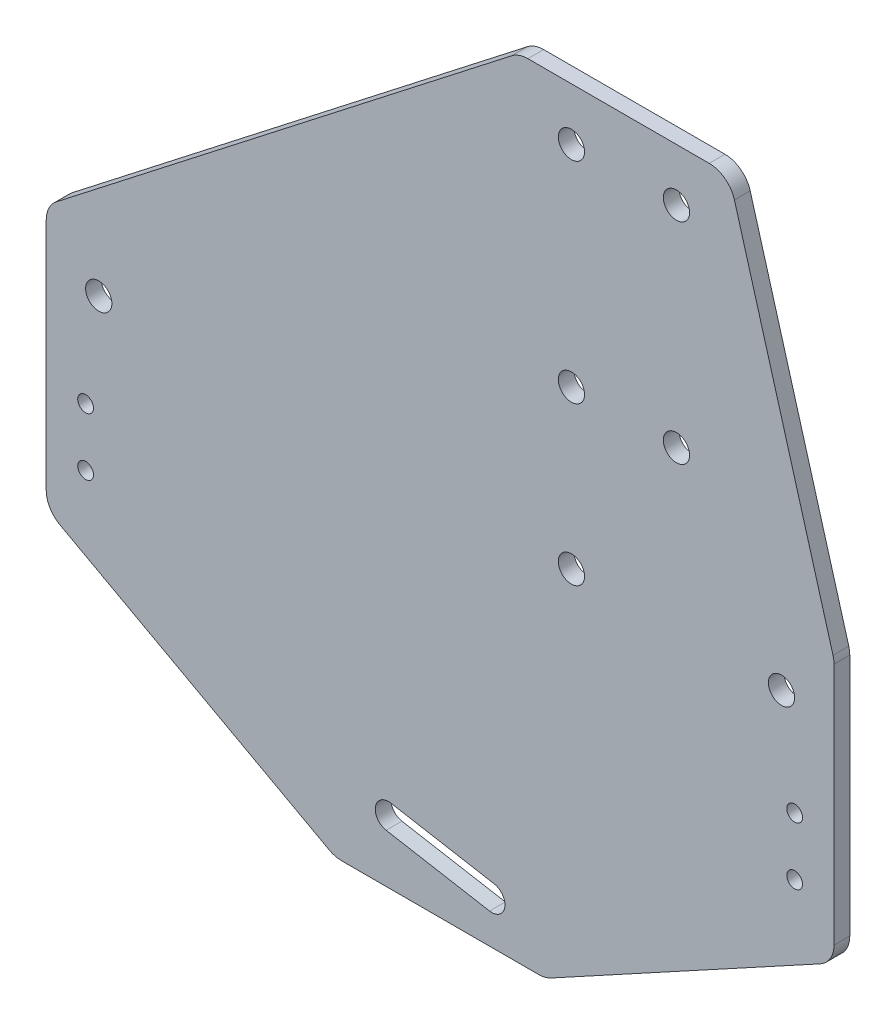
ISO-10303-21;
HEADER;
FILE_DESCRIPTION(('STEP AP214'),'2;1');
FILE_NAME('part.step','',(''),(''),'','','');
FILE_SCHEMA(('AUTOMOTIVE_DESIGN { 1 0 10303 214 1 1 1 1 }'));
ENDSEC;
DATA;
#1=APPLICATION_CONTEXT('core data for automotive mechanical design processes');
#2=APPLICATION_PROTOCOL_DEFINITION('international standard','automotive_design',2000,#1);
#3=PRODUCT_CONTEXT('',#1,'mechanical');
#4=PRODUCT('Part','Part','',(#3));
#5=PRODUCT_RELATED_PRODUCT_CATEGORY('part','',(#4));
#6=PRODUCT_DEFINITION_FORMATION('','',#4);
#7=PRODUCT_DEFINITION_CONTEXT('part definition',#1,'design');
#8=PRODUCT_DEFINITION('design','',#6,#7);
#9=PRODUCT_DEFINITION_SHAPE('','',#8);
#10=(LENGTH_UNIT() NAMED_UNIT(*) SI_UNIT(.MILLI.,.METRE.));
#11=(NAMED_UNIT(*) PLANE_ANGLE_UNIT() SI_UNIT($,.RADIAN.));
#12=(NAMED_UNIT(*) SI_UNIT($,.STERADIAN.) SOLID_ANGLE_UNIT());
#13=UNCERTAINTY_MEASURE_WITH_UNIT(LENGTH_MEASURE(1.E-05),#10,'distance_accuracy_value','');
#14=(GEOMETRIC_REPRESENTATION_CONTEXT(3) GLOBAL_UNCERTAINTY_ASSIGNED_CONTEXT((#13)) GLOBAL_UNIT_ASSIGNED_CONTEXT((#10,
#11,#12)) REPRESENTATION_CONTEXT('',''));
#15=CARTESIAN_POINT('',(0.,0.,0.));
#16=DIRECTION('',(0.,0.,1.));
#17=DIRECTION('',(1.,0.,0.));
#18=AXIS2_PLACEMENT_3D('',#15,#16,#17);
#19=CARTESIAN_POINT('',(15.,150.,3.));
#20=DIRECTION('',(0.,-1.,0.));
#21=DIRECTION('',(0.,0.,-1.));
#22=AXIS2_PLACEMENT_3D('',#19,#20,#21);
#23=PLANE('',#22);
#24=DIRECTION('',(-1.,0.,0.));
#25=VECTOR('',#24,1.);
#26=CARTESIAN_POINT('',(15.,150.,3.));
#27=LINE('',#26,#25);
#28=CARTESIAN_POINT('',(51.2284929362282,150.,3.));
#29=VERTEX_POINT('',#28);
#30=CARTESIAN_POINT('',(16.7155387507081,150.,3.));
#31=VERTEX_POINT('',#30);
#32=EDGE_CURVE('E226',#29,#31,#27,.T.);
#33=ORIENTED_EDGE('',*,*,#32,.F.);
#34=DIRECTION('',(0.,0.,-1.));
#35=VECTOR('',#34,1.);
#36=CARTESIAN_POINT('',(51.2284929362282,150.,3.));
#37=LINE('',#36,#35);
#38=CARTESIAN_POINT('',(51.2284929362282,150.,0.));
#39=VERTEX_POINT('',#38);
#40=EDGE_CURVE('E327',#29,#39,#37,.T.);
#41=ORIENTED_EDGE('',*,*,#40,.T.);
#42=DIRECTION('',(-1.,0.,0.));
#43=VECTOR('',#42,1.);
#44=CARTESIAN_POINT('',(15.,150.,0.));
#45=LINE('',#44,#43);
#46=CARTESIAN_POINT('',(16.7155387507081,150.,0.));
#47=VERTEX_POINT('',#46);
#48=EDGE_CURVE('E223',#39,#47,#45,.T.);
#49=ORIENTED_EDGE('',*,*,#48,.T.);
#50=DIRECTION('',(0.,0.,-1.));
#51=VECTOR('',#50,1.);
#52=CARTESIAN_POINT('',(16.7155387507081,150.,3.));
#53=LINE('',#52,#51);
#54=EDGE_CURVE('E325',#47,#31,#53,.F.);
#55=ORIENTED_EDGE('',*,*,#54,.T.);
#56=EDGE_LOOP('',(#33,#41,#49,#55));
#57=FACE_BOUND('',#56,.T.);
#58=ADVANCED_FACE('F33',(#57),#23,.F.);
#59=CARTESIAN_POINT('',(-75.,80.,3.));
#60=DIRECTION('',(0.61394061351492,-0.789352217376326,0.));
#61=DIRECTION('',(0.789352217376326,0.61394061351492,0.));
#62=AXIS2_PLACEMENT_3D('',#59,#60,#61);
#63=PLANE('',#62);
#64=DIRECTION('',(-0.789352217376326,-0.61394061351492,0.));
#65=VECTOR('',#64,1.);
#66=CARTESIAN_POINT('',(-75.,80.,3.));
#67=LINE('',#66,#65);
#68=CARTESIAN_POINT('',(13.6458356831335,148.946761086882,3.));
#69=VERTEX_POINT('',#68);
#70=CARTESIAN_POINT('',(-73.0697030675746,81.5013420585531,3.));
#71=VERTEX_POINT('',#70);
#72=EDGE_CURVE('E229',#69,#71,#67,.T.);
#73=ORIENTED_EDGE('',*,*,#72,.F.);
#74=DIRECTION('',(0.,0.,-1.));
#75=VECTOR('',#74,1.);
#76=CARTESIAN_POINT('',(13.6458356831335,148.946761086882,3.));
#77=LINE('',#76,#75);
#78=CARTESIAN_POINT('',(13.6458356831335,148.946761086882,0.));
#79=VERTEX_POINT('',#78);
#80=EDGE_CURVE('E332',#69,#79,#77,.T.);
#81=ORIENTED_EDGE('',*,*,#80,.T.);
#82=DIRECTION('',(-0.789352217376326,-0.61394061351492,0.));
#83=VECTOR('',#82,1.);
#84=CARTESIAN_POINT('',(-75.,80.,0.));
#85=LINE('',#84,#83);
#86=CARTESIAN_POINT('',(-73.0697030675746,81.5013420585531,0.));
#87=VERTEX_POINT('',#86);
#88=EDGE_CURVE('E248',#79,#87,#85,.T.);
#89=ORIENTED_EDGE('',*,*,#88,.T.);
#90=DIRECTION('',(0.,0.,-1.));
#91=VECTOR('',#90,1.);
#92=CARTESIAN_POINT('',(-73.0697030675746,81.5013420585531,3.));
#93=LINE('',#92,#91);
#94=EDGE_CURVE('E330',#87,#71,#93,.F.);
#95=ORIENTED_EDGE('',*,*,#94,.T.);
#96=EDGE_LOOP('',(#73,#81,#89,#95));
#97=FACE_BOUND('',#96,.T.);
#98=ADVANCED_FACE('F361',(#97),#63,.F.);
#99=CARTESIAN_POINT('',(-75.,0.,3.));
#100=DIRECTION('',(1.,0.,0.));
#101=DIRECTION('',(0.,0.,-1.));
#102=AXIS2_PLACEMENT_3D('',#99,#100,#101);
#103=PLANE('',#102);
#104=DIRECTION('',(0.,-1.,0.));
#105=VECTOR('',#104,1.);
#106=CARTESIAN_POINT('',(-75.,0.,0.));
#107=LINE('',#106,#105);
#108=CARTESIAN_POINT('',(-75.,77.5545809716715,0.));
#109=VERTEX_POINT('',#108);
#110=CARTESIAN_POINT('',(-75.,32.9681654937008,0.));
#111=VERTEX_POINT('',#110);
#112=EDGE_CURVE('E251',#109,#111,#107,.T.);
#113=ORIENTED_EDGE('',*,*,#112,.T.);
#114=DIRECTION('',(0.,0.,1.));
#115=VECTOR('',#114,1.);
#116=CARTESIAN_POINT('',(-75.,32.9681654937008,3.));
#117=LINE('',#116,#115);
#118=CARTESIAN_POINT('',(-75.,32.9681654937008,3.));
#119=VERTEX_POINT('',#118);
#120=EDGE_CURVE('E11',#111,#119,#117,.T.);
#121=ORIENTED_EDGE('',*,*,#120,.T.);
#122=DIRECTION('',(0.,-1.,0.));
#123=VECTOR('',#122,1.);
#124=CARTESIAN_POINT('',(-75.,0.,3.));
#125=LINE('',#124,#123);
#126=CARTESIAN_POINT('',(-75.,77.5545809716715,3.));
#127=VERTEX_POINT('',#126);
#128=EDGE_CURVE('E233',#127,#119,#125,.T.);
#129=ORIENTED_EDGE('',*,*,#128,.F.);
#130=DIRECTION('',(0.,0.,-1.));
#131=VECTOR('',#130,1.);
#132=CARTESIAN_POINT('',(-75.,77.5545809716715,3.));
#133=LINE('',#132,#131);
#134=EDGE_CURVE('E41',#127,#109,#133,.T.);
#135=ORIENTED_EDGE('',*,*,#134,.T.);
#136=EDGE_LOOP('',(#113,#121,#129,#135));
#137=FACE_BOUND('',#136,.T.);
#138=ADVANCED_FACE('F339',(#137),#103,.F.);
#139=CARTESIAN_POINT('',(-75.,0.,3.));
#140=DIRECTION('',(0.,1.,0.));
#141=DIRECTION('',(-1.,0.,0.));
#142=AXIS2_PLACEMENT_3D('',#139,#140,#141);
#143=PLANE('',#142);
#144=DIRECTION('',(1.,0.,0.));
#145=VECTOR('',#144,1.);
#146=CARTESIAN_POINT('',(-75.,0.,3.));
#147=LINE('',#146,#145);
#148=CARTESIAN_POINT('',(-18.7250299282153,0.,3.));
#149=VERTEX_POINT('',#148);
#150=CARTESIAN_POINT('',(18.7250299282153,0.,3.));
#151=VERTEX_POINT('',#150);
#152=EDGE_CURVE('E236',#149,#151,#147,.T.);
#153=ORIENTED_EDGE('',*,*,#152,.F.);
#154=DIRECTION('',(0.,0.,1.));
#155=VECTOR('',#154,1.);
#156=CARTESIAN_POINT('',(-18.7250299282153,0.,3.));
#157=LINE('',#156,#155);
#158=CARTESIAN_POINT('',(-18.7250299282153,0.,0.));
#159=VERTEX_POINT('',#158);
#160=EDGE_CURVE('E296',#149,#159,#157,.F.);
#161=ORIENTED_EDGE('',*,*,#160,.T.);
#162=DIRECTION('',(1.,0.,0.));
#163=VECTOR('',#162,1.);
#164=CARTESIAN_POINT('',(-75.,0.,0.));
#165=LINE('',#164,#163);
#166=CARTESIAN_POINT('',(18.7250299282153,0.,0.));
#167=VERTEX_POINT('',#166);
#168=EDGE_CURVE('E254',#159,#167,#165,.T.);
#169=ORIENTED_EDGE('',*,*,#168,.T.);
#170=DIRECTION('',(0.,0.,1.));
#171=VECTOR('',#170,1.);
#172=CARTESIAN_POINT('',(18.7250299282153,0.,3.));
#173=LINE('',#172,#171);
#174=EDGE_CURVE('E293',#167,#151,#173,.T.);
#175=ORIENTED_EDGE('',*,*,#174,.T.);
#176=EDGE_LOOP('',(#153,#161,#169,#175));
#177=FACE_BOUND('',#176,.T.);
#178=ADVANCED_FACE('F490',(#177),#143,.F.);
#179=CARTESIAN_POINT('',(75.,0.,3.));
#180=DIRECTION('',(-1.,0.,0.));
#181=DIRECTION('',(0.,-1.,0.));
#182=AXIS2_PLACEMENT_3D('',#179,#180,#181);
#183=PLANE('',#182);
#184=DIRECTION('',(0.,1.,0.));
#185=VECTOR('',#184,1.);
#186=CARTESIAN_POINT('',(75.,0.,3.));
#187=LINE('',#186,#185);
#188=CARTESIAN_POINT('',(75.,32.9681654937008,3.));
#189=VERTEX_POINT('',#188);
#190=CARTESIAN_POINT('',(75.,79.2997252767988,3.));
#191=VERTEX_POINT('',#190);
#192=EDGE_CURVE('E239',#189,#191,#187,.T.);
#193=ORIENTED_EDGE('',*,*,#192,.F.);
#194=DIRECTION('',(0.,0.,1.));
#195=VECTOR('',#194,1.);
#196=CARTESIAN_POINT('',(75.,32.9681654937008,3.));
#197=LINE('',#196,#195);
#198=CARTESIAN_POINT('',(75.,32.9681654937008,0.));
#199=VERTEX_POINT('',#198);
#200=EDGE_CURVE('E319',#189,#199,#197,.F.);
#201=ORIENTED_EDGE('',*,*,#200,.T.);
#202=DIRECTION('',(0.,1.,0.));
#203=VECTOR('',#202,1.);
#204=CARTESIAN_POINT('',(75.,0.,0.));
#205=LINE('',#204,#203);
#206=CARTESIAN_POINT('',(75.,79.2997252767988,0.));
#207=VERTEX_POINT('',#206);
#208=EDGE_CURVE('E257',#199,#207,#205,.T.);
#209=ORIENTED_EDGE('',*,*,#208,.T.);
#210=DIRECTION('',(0.,0.,-1.));
#211=VECTOR('',#210,1.);
#212=CARTESIAN_POINT('',(75.,79.2997252767988,3.));
#213=LINE('',#212,#211);
#214=EDGE_CURVE('E317',#207,#191,#213,.F.);
#215=ORIENTED_EDGE('',*,*,#214,.T.);
#216=EDGE_LOOP('',(#193,#201,#209,#215));
#217=FACE_BOUND('',#216,.T.);
#218=ADVANCED_FACE('F383',(#217),#183,.F.);
#219=CARTESIAN_POINT('',(75.,80.,3.));
#220=DIRECTION('',(-0.961523947640823,-0.274721127897378,0.));
#221=DIRECTION('',(0.274721127897378,-0.961523947640823,0.));
#222=AXIS2_PLACEMENT_3D('',#219,#220,#221);
#223=PLANE('',#222);
#224=DIRECTION('',(-0.274721127897378,0.961523947640823,0.));
#225=VECTOR('',#224,1.);
#226=CARTESIAN_POINT('',(75.,80.,3.));
#227=LINE('',#226,#225);
#228=CARTESIAN_POINT('',(74.8076197382041,80.6733309162857,3.));
#229=VERTEX_POINT('',#228);
#230=CARTESIAN_POINT('',(56.0361126744323,146.373605639487,3.));
#231=VERTEX_POINT('',#230);
#232=EDGE_CURVE('E242',#229,#231,#227,.T.);
#233=ORIENTED_EDGE('',*,*,#232,.F.);
#234=DIRECTION('',(0.,0.,-1.));
#235=VECTOR('',#234,1.);
#236=CARTESIAN_POINT('',(74.8076197382041,80.6733309162857,3.));
#237=LINE('',#236,#235);
#238=CARTESIAN_POINT('',(74.8076197382041,80.6733309162857,0.));
#239=VERTEX_POINT('',#238);
#240=EDGE_CURVE('E323',#229,#239,#237,.T.);
#241=ORIENTED_EDGE('',*,*,#240,.T.);
#242=DIRECTION('',(-0.274721127897378,0.961523947640823,0.));
#243=VECTOR('',#242,1.);
#244=CARTESIAN_POINT('',(75.,80.,0.));
#245=LINE('',#244,#243);
#246=CARTESIAN_POINT('',(56.0361126744323,146.373605639487,0.));
#247=VERTEX_POINT('',#246);
#248=EDGE_CURVE('E230',#239,#247,#245,.T.);
#249=ORIENTED_EDGE('',*,*,#248,.T.);
#250=DIRECTION('',(0.,0.,-1.));
#251=VECTOR('',#250,1.);
#252=CARTESIAN_POINT('',(56.0361126744323,146.373605639487,3.));
#253=LINE('',#252,#251);
#254=EDGE_CURVE('E321',#247,#231,#253,.F.);
#255=ORIENTED_EDGE('',*,*,#254,.T.);
#256=EDGE_LOOP('',(#233,#241,#249,#255));
#257=FACE_BOUND('',#256,.T.);
#258=ADVANCED_FACE('F376',(#257),#223,.F.);
#259=CARTESIAN_POINT('',(0.,0.,3.));
#260=DIRECTION('',(0.,0.,1.));
#261=DIRECTION('',(1.,0.,0.));
#262=AXIS2_PLACEMENT_3D('',#259,#260,#261);
#263=PLANE('',#262);
#264=DIRECTION('',(-0.877895572914384,0.478852130680573,0.));
#265=VECTOR('',#264,1.);
#266=CARTESIAN_POINT('',(-75.,30.,3.));
#267=LINE('',#266,#265);
#268=CARTESIAN_POINT('',(-21.1192905816182,0.610522135428098,3.));
#269=VERTEX_POINT('',#268);
#270=CARTESIAN_POINT('',(-72.3942606534029,28.5786876291288,3.));
#271=VERTEX_POINT('',#270);
#272=EDGE_CURVE('E397',#269,#271,#267,.T.);
#273=ORIENTED_EDGE('',*,*,#272,.F.);
#274=CARTESIAN_POINT('',(-18.7250299282153,5.00000000000001,3.));
#275=DIRECTION('',(0.,0.,1.));
#276=DIRECTION('',(1.,0.,0.));
#277=AXIS2_PLACEMENT_3D('',#274,#275,#276);
#278=CIRCLE('',#277,5.);
#279=EDGE_CURVE('E291',#269,#149,#278,.T.);
#280=ORIENTED_EDGE('',*,*,#279,.T.);
#281=ORIENTED_EDGE('',*,*,#152,.T.);
#282=CARTESIAN_POINT('',(18.7250299282153,5.00000000000002,3.));
#283=DIRECTION('',(0.,0.,1.));
#284=DIRECTION('',(1.,0.,0.));
#285=AXIS2_PLACEMENT_3D('',#282,#283,#284);
#286=CIRCLE('',#285,5.);
#287=CARTESIAN_POINT('',(21.1192905816182,0.610522135428098,3.));
#288=VERTEX_POINT('',#287);
#289=EDGE_CURVE('E289',#151,#288,#286,.T.);
#290=ORIENTED_EDGE('',*,*,#289,.T.);
#291=DIRECTION('',(-0.877895572914384,-0.478852130680574,0.));
#292=VECTOR('',#291,1.);
#293=CARTESIAN_POINT('',(20.,0.,3.));
#294=LINE('',#293,#292);
#295=CARTESIAN_POINT('',(72.3942606534029,28.5786876291288,3.));
#296=VERTEX_POINT('',#295);
#297=EDGE_CURVE('E398',#296,#288,#294,.T.);
#298=ORIENTED_EDGE('',*,*,#297,.F.);
#299=CARTESIAN_POINT('',(70.,32.9681654937008,3.));
#300=DIRECTION('',(0.,0.,1.));
#301=DIRECTION('',(1.,0.,0.));
#302=AXIS2_PLACEMENT_3D('',#299,#300,#301);
#303=CIRCLE('',#302,5.);
#304=EDGE_CURVE('E287',#296,#189,#303,.T.);
#305=ORIENTED_EDGE('',*,*,#304,.T.);
#306=ORIENTED_EDGE('',*,*,#192,.T.);
#307=CARTESIAN_POINT('',(70.,79.2997252767988,3.));
#308=DIRECTION('',(0.,0.,1.));
#309=DIRECTION('',(1.,0.,0.));
#310=AXIS2_PLACEMENT_3D('',#307,#308,#309);
#311=CIRCLE('',#310,5.);
#312=EDGE_CURVE('E285',#191,#229,#311,.T.);
#313=ORIENTED_EDGE('',*,*,#312,.T.);
#314=ORIENTED_EDGE('',*,*,#232,.T.);
#315=CARTESIAN_POINT('',(51.2284929362282,145.,3.));
#316=DIRECTION('',(0.,0.,1.));
#317=DIRECTION('',(1.,0.,0.));
#318=AXIS2_PLACEMENT_3D('',#315,#316,#317);
#319=CIRCLE('',#318,5.);
#320=EDGE_CURVE('E283',#231,#29,#319,.T.);
#321=ORIENTED_EDGE('',*,*,#320,.T.);
#322=ORIENTED_EDGE('',*,*,#32,.T.);
#323=CARTESIAN_POINT('',(16.7155387507081,145.,3.));
#324=DIRECTION('',(0.,0.,1.));
#325=DIRECTION('',(1.,0.,0.));
#326=AXIS2_PLACEMENT_3D('',#323,#324,#325);
#327=CIRCLE('',#326,5.);
#328=EDGE_CURVE('E281',#31,#69,#327,.T.);
#329=ORIENTED_EDGE('',*,*,#328,.T.);
#330=ORIENTED_EDGE('',*,*,#72,.T.);
#331=CARTESIAN_POINT('',(-70.,77.5545809716715,3.));
#332=DIRECTION('',(0.,0.,1.));
#333=DIRECTION('',(1.,0.,0.));
#334=AXIS2_PLACEMENT_3D('',#331,#332,#333);
#335=CIRCLE('',#334,5.);
#336=EDGE_CURVE('E277',#71,#127,#335,.T.);
#337=ORIENTED_EDGE('',*,*,#336,.T.);
#338=ORIENTED_EDGE('',*,*,#128,.T.);
#339=CARTESIAN_POINT('',(-70.,32.9681654937008,3.));
#340=DIRECTION('',(0.,0.,1.));
#341=DIRECTION('',(1.,0.,0.));
#342=AXIS2_PLACEMENT_3D('',#339,#340,#341);
#343=CIRCLE('',#342,5.);
#344=EDGE_CURVE('E279',#119,#271,#343,.T.);
#345=ORIENTED_EDGE('',*,*,#344,.T.);
#346=EDGE_LOOP('',(#273,#280,#281,#290,#298,#305,#306,#313,#314,#321,#322,#329,#330,#337,#338,#345));
#347=FACE_BOUND('',#346,.T.);
#348=CARTESIAN_POINT('',(25.,140.,3.));
#349=DIRECTION('',(0.,0.,1.));
#350=DIRECTION('',(1.,0.,0.));
#351=AXIS2_PLACEMENT_3D('',#348,#349,#350);
#352=CIRCLE('',#351,2.5);
#353=CARTESIAN_POINT('',(27.5,140.,3.));
#354=VERTEX_POINT('',#353);
#355=EDGE_CURVE('E407',#354,#354,#352,.T.);
#356=ORIENTED_EDGE('',*,*,#355,.F.);
#357=EDGE_LOOP('',(#356));
#358=FACE_BOUND('',#357,.T.);
#359=CARTESIAN_POINT('',(45.,140.,3.));
#360=DIRECTION('',(0.,0.,1.));
#361=DIRECTION('',(1.,0.,0.));
#362=AXIS2_PLACEMENT_3D('',#359,#360,#361);
#363=CIRCLE('',#362,2.5);
#364=CARTESIAN_POINT('',(47.5,140.,3.));
#365=VERTEX_POINT('',#364);
#366=EDGE_CURVE('E410',#365,#365,#363,.T.);
#367=ORIENTED_EDGE('',*,*,#366,.F.);
#368=EDGE_LOOP('',(#367));
#369=FACE_BOUND('',#368,.T.);
#370=CARTESIAN_POINT('',(-67.5,40.,3.));
#371=DIRECTION('',(0.,0.,1.));
#372=DIRECTION('',(1.,0.,0.));
#373=AXIS2_PLACEMENT_3D('',#370,#371,#372);
#374=CIRCLE('',#373,1.5);
#375=CARTESIAN_POINT('',(-66.,40.,3.));
#376=VERTEX_POINT('',#375);
#377=EDGE_CURVE('E414',#376,#376,#374,.T.);
#378=ORIENTED_EDGE('',*,*,#377,.F.);
#379=EDGE_LOOP('',(#378));
#380=FACE_BOUND('',#379,.T.);
#381=CARTESIAN_POINT('',(-67.5,51.,3.));
#382=DIRECTION('',(0.,0.,1.));
#383=DIRECTION('',(1.,0.,0.));
#384=AXIS2_PLACEMENT_3D('',#381,#382,#383);
#385=CIRCLE('',#384,1.5);
#386=CARTESIAN_POINT('',(-66.,51.,3.));
#387=VERTEX_POINT('',#386);
#388=EDGE_CURVE('E420',#387,#387,#385,.T.);
#389=ORIENTED_EDGE('',*,*,#388,.F.);
#390=EDGE_LOOP('',(#389));
#391=FACE_BOUND('',#390,.T.);
#392=CARTESIAN_POINT('',(67.5,40.,3.));
#393=DIRECTION('',(0.,0.,1.));
#394=DIRECTION('',(1.,0.,0.));
#395=AXIS2_PLACEMENT_3D('',#392,#393,#394);
#396=CIRCLE('',#395,1.5);
#397=CARTESIAN_POINT('',(69.,40.,3.));
#398=VERTEX_POINT('',#397);
#399=EDGE_CURVE('E426',#398,#398,#396,.T.);
#400=ORIENTED_EDGE('',*,*,#399,.F.);
#401=EDGE_LOOP('',(#400));
#402=FACE_BOUND('',#401,.T.);
#403=CARTESIAN_POINT('',(67.5,51.,3.));
#404=DIRECTION('',(0.,0.,1.));
#405=DIRECTION('',(1.,0.,0.));
#406=AXIS2_PLACEMENT_3D('',#403,#404,#405);
#407=CIRCLE('',#406,1.5);
#408=CARTESIAN_POINT('',(69.,51.,3.));
#409=VERTEX_POINT('',#408);
#410=EDGE_CURVE('E432',#409,#409,#407,.T.);
#411=ORIENTED_EDGE('',*,*,#410,.F.);
#412=EDGE_LOOP('',(#411));
#413=FACE_BOUND('',#412,.T.);
#414=CARTESIAN_POINT('',(25.,70.,3.));
#415=DIRECTION('',(0.,0.,1.));
#416=DIRECTION('',(-1.,0.,0.));
#417=AXIS2_PLACEMENT_3D('',#414,#415,#416);
#418=CIRCLE('',#417,2.5);
#419=CARTESIAN_POINT('',(22.5,70.,3.));
#420=VERTEX_POINT('',#419);
#421=EDGE_CURVE('E438',#420,#420,#418,.T.);
#422=ORIENTED_EDGE('',*,*,#421,.F.);
#423=EDGE_LOOP('',(#422));
#424=FACE_BOUND('',#423,.T.);
#425=CARTESIAN_POINT('',(65.,70.,3.));
#426=DIRECTION('',(0.,0.,1.));
#427=DIRECTION('',(-1.,0.,0.));
#428=AXIS2_PLACEMENT_3D('',#425,#426,#427);
#429=CIRCLE('',#428,2.50000000000001);
#430=CARTESIAN_POINT('',(62.5,70.,3.));
#431=VERTEX_POINT('',#430);
#432=EDGE_CURVE('E203',#431,#431,#429,.T.);
#433=ORIENTED_EDGE('',*,*,#432,.F.);
#434=EDGE_LOOP('',(#433));
#435=FACE_BOUND('',#434,.T.);
#436=CARTESIAN_POINT('',(-9.84807753012208,11.7364817766693,3.));
#437=DIRECTION('',(0.,0.,1.));
#438=DIRECTION('',(1.,0.,0.));
#439=AXIS2_PLACEMENT_3D('',#436,#437,#438);
#440=CIRCLE('',#439,2.5);
#441=CARTESIAN_POINT('',(-9.41395708595475,14.1985011591998,3.));
#442=VERTEX_POINT('',#441);
#443=CARTESIAN_POINT('',(-10.2821979742894,9.27446239413879,3.));
#444=VERTEX_POINT('',#443);
#445=EDGE_CURVE('E179',#442,#444,#440,.T.);
#446=ORIENTED_EDGE('',*,*,#445,.F.);
#447=DIRECTION('',(-0.984807753012208,0.173648177666931,0.));
#448=VECTOR('',#447,1.);
#449=CARTESIAN_POINT('',(-9.41395708595475,14.1985011591998,3.));
#450=LINE('',#449,#448);
#451=CARTESIAN_POINT('',(10.2821979742894,10.7255376058612,3.));
#452=VERTEX_POINT('',#451);
#453=EDGE_CURVE('E197',#452,#442,#450,.T.);
#454=ORIENTED_EDGE('',*,*,#453,.F.);
#455=CARTESIAN_POINT('',(9.84807753012208,8.2635182233307,3.));
#456=DIRECTION('',(0.,0.,1.));
#457=DIRECTION('',(1.,0.,0.));
#458=AXIS2_PLACEMENT_3D('',#455,#456,#457);
#459=CIRCLE('',#458,2.5);
#460=CARTESIAN_POINT('',(9.41395708595476,5.80149884080018,3.));
#461=VERTEX_POINT('',#460);
#462=EDGE_CURVE('E200',#461,#452,#459,.T.);
#463=ORIENTED_EDGE('',*,*,#462,.F.);
#464=DIRECTION('',(0.984807753012208,-0.17364817766693,0.));
#465=VECTOR('',#464,1.);
#466=CARTESIAN_POINT('',(-10.2821979742894,9.27446239413879,3.));
#467=LINE('',#466,#465);
#468=EDGE_CURVE('E209',#444,#461,#467,.T.);
#469=ORIENTED_EDGE('',*,*,#468,.F.);
#470=EDGE_LOOP('',(#446,#454,#463,#469));
#471=FACE_BOUND('',#470,.T.);
#472=CARTESIAN_POINT('',(-65.,70.,3.));
#473=DIRECTION('',(0.,0.,1.));
#474=DIRECTION('',(1.,0.,0.));
#475=AXIS2_PLACEMENT_3D('',#472,#473,#474);
#476=CIRCLE('',#475,2.50000000000001);
#477=CARTESIAN_POINT('',(-62.5,70.,3.));
#478=VERTEX_POINT('',#477);
#479=EDGE_CURVE('E216',#478,#478,#476,.T.);
#480=ORIENTED_EDGE('',*,*,#479,.F.);
#481=EDGE_LOOP('',(#480));
#482=FACE_BOUND('',#481,.T.);
#483=CARTESIAN_POINT('',(45.,100.,3.));
#484=DIRECTION('',(0.,0.,1.));
#485=DIRECTION('',(1.,0.,0.));
#486=AXIS2_PLACEMENT_3D('',#483,#484,#485);
#487=CIRCLE('',#486,2.5);
#488=CARTESIAN_POINT('',(47.5,100.,3.));
#489=VERTEX_POINT('',#488);
#490=EDGE_CURVE('E263',#489,#489,#487,.T.);
#491=ORIENTED_EDGE('',*,*,#490,.F.);
#492=EDGE_LOOP('',(#491));
#493=FACE_BOUND('',#492,.T.);
#494=CARTESIAN_POINT('',(25.,100.,3.));
#495=DIRECTION('',(0.,0.,1.));
#496=DIRECTION('',(1.,0.,0.));
#497=AXIS2_PLACEMENT_3D('',#494,#495,#496);
#498=CIRCLE('',#497,2.5);
#499=CARTESIAN_POINT('',(27.5,100.,3.));
#500=VERTEX_POINT('',#499);
#501=EDGE_CURVE('E269',#500,#500,#498,.T.);
#502=ORIENTED_EDGE('',*,*,#501,.F.);
#503=EDGE_LOOP('',(#502));
#504=FACE_BOUND('',#503,.T.);
#505=ADVANCED_FACE('F355',(#347,#358,#369,#380,#391,#402,#413,#424,#435,#471,#482,#493,#504),
#263,.T.);
#506=CARTESIAN_POINT('',(0.,0.,0.));
#507=DIRECTION('',(0.,0.,1.));
#508=DIRECTION('',(1.,0.,0.));
#509=AXIS2_PLACEMENT_3D('',#506,#507,#508);
#510=PLANE('',#509);
#511=CARTESIAN_POINT('',(25.,140.,0.));
#512=DIRECTION('',(0.,0.,1.));
#513=DIRECTION('',(1.,0.,0.));
#514=AXIS2_PLACEMENT_3D('',#511,#512,#513);
#515=CIRCLE('',#514,2.5);
#516=CARTESIAN_POINT('',(27.5,140.,0.));
#517=VERTEX_POINT('',#516);
#518=EDGE_CURVE('E403',#517,#517,#515,.T.);
#519=ORIENTED_EDGE('',*,*,#518,.T.);
#520=EDGE_LOOP('',(#519));
#521=FACE_BOUND('',#520,.T.);
#522=CARTESIAN_POINT('',(45.,140.,0.));
#523=DIRECTION('',(0.,0.,1.));
#524=DIRECTION('',(1.,0.,0.));
#525=AXIS2_PLACEMENT_3D('',#522,#523,#524);
#526=CIRCLE('',#525,2.5);
#527=CARTESIAN_POINT('',(47.5,140.,0.));
#528=VERTEX_POINT('',#527);
#529=EDGE_CURVE('E411',#528,#528,#526,.T.);
#530=ORIENTED_EDGE('',*,*,#529,.T.);
#531=EDGE_LOOP('',(#530));
#532=FACE_BOUND('',#531,.T.);
#533=CARTESIAN_POINT('',(-67.5,40.,0.));
#534=DIRECTION('',(0.,0.,1.));
#535=DIRECTION('',(1.,0.,0.));
#536=AXIS2_PLACEMENT_3D('',#533,#534,#535);
#537=CIRCLE('',#536,1.5);
#538=CARTESIAN_POINT('',(-66.,40.,0.));
#539=VERTEX_POINT('',#538);
#540=EDGE_CURVE('E417',#539,#539,#537,.T.);
#541=ORIENTED_EDGE('',*,*,#540,.T.);
#542=EDGE_LOOP('',(#541));
#543=FACE_BOUND('',#542,.T.);
#544=CARTESIAN_POINT('',(-67.5,51.,0.));
#545=DIRECTION('',(0.,0.,1.));
#546=DIRECTION('',(1.,0.,0.));
#547=AXIS2_PLACEMENT_3D('',#544,#545,#546);
#548=CIRCLE('',#547,1.5);
#549=CARTESIAN_POINT('',(-66.,51.,0.));
#550=VERTEX_POINT('',#549);
#551=EDGE_CURVE('E423',#550,#550,#548,.T.);
#552=ORIENTED_EDGE('',*,*,#551,.T.);
#553=EDGE_LOOP('',(#552));
#554=FACE_BOUND('',#553,.T.);
#555=CARTESIAN_POINT('',(67.5,40.,0.));
#556=DIRECTION('',(0.,0.,1.));
#557=DIRECTION('',(1.,0.,0.));
#558=AXIS2_PLACEMENT_3D('',#555,#556,#557);
#559=CIRCLE('',#558,1.5);
#560=CARTESIAN_POINT('',(69.,40.,0.));
#561=VERTEX_POINT('',#560);
#562=EDGE_CURVE('E429',#561,#561,#559,.T.);
#563=ORIENTED_EDGE('',*,*,#562,.T.);
#564=EDGE_LOOP('',(#563));
#565=FACE_BOUND('',#564,.T.);
#566=CARTESIAN_POINT('',(67.5,51.,0.));
#567=DIRECTION('',(0.,0.,1.));
#568=DIRECTION('',(1.,0.,0.));
#569=AXIS2_PLACEMENT_3D('',#566,#567,#568);
#570=CIRCLE('',#569,1.5);
#571=CARTESIAN_POINT('',(69.,51.,0.));
#572=VERTEX_POINT('',#571);
#573=EDGE_CURVE('E435',#572,#572,#570,.T.);
#574=ORIENTED_EDGE('',*,*,#573,.T.);
#575=EDGE_LOOP('',(#574));
#576=FACE_BOUND('',#575,.T.);
#577=CARTESIAN_POINT('',(25.,70.,0.));
#578=DIRECTION('',(0.,0.,1.));
#579=DIRECTION('',(-1.,0.,0.));
#580=AXIS2_PLACEMENT_3D('',#577,#578,#579);
#581=CIRCLE('',#580,2.5);
#582=CARTESIAN_POINT('',(22.5,70.,0.));
#583=VERTEX_POINT('',#582);
#584=EDGE_CURVE('E441',#583,#583,#581,.T.);
#585=ORIENTED_EDGE('',*,*,#584,.T.);
#586=EDGE_LOOP('',(#585));
#587=FACE_BOUND('',#586,.T.);
#588=CARTESIAN_POINT('',(65.,70.,0.));
#589=DIRECTION('',(0.,0.,1.));
#590=DIRECTION('',(-1.,0.,0.));
#591=AXIS2_PLACEMENT_3D('',#588,#589,#590);
#592=CIRCLE('',#591,2.50000000000001);
#593=CARTESIAN_POINT('',(62.5,70.,0.));
#594=VERTEX_POINT('',#593);
#595=EDGE_CURVE('E210',#594,#594,#592,.T.);
#596=ORIENTED_EDGE('',*,*,#595,.T.);
#597=EDGE_LOOP('',(#596));
#598=FACE_BOUND('',#597,.T.);
#599=DIRECTION('',(-0.984807753012208,0.173648177666931,0.));
#600=VECTOR('',#599,1.);
#601=CARTESIAN_POINT('',(-9.41395708595475,14.1985011591998,0.));
#602=LINE('',#601,#600);
#603=CARTESIAN_POINT('',(10.2821979742894,10.7255376058612,0.));
#604=VERTEX_POINT('',#603);
#605=CARTESIAN_POINT('',(-9.41395708595475,14.1985011591998,0.));
#606=VERTEX_POINT('',#605);
#607=EDGE_CURVE('E184',#604,#606,#602,.T.);
#608=ORIENTED_EDGE('',*,*,#607,.T.);
#609=CARTESIAN_POINT('',(-9.84807753012208,11.7364817766693,0.));
#610=DIRECTION('',(0.,0.,1.));
#611=DIRECTION('',(1.,0.,0.));
#612=AXIS2_PLACEMENT_3D('',#609,#610,#611);
#613=CIRCLE('',#612,2.5);
#614=CARTESIAN_POINT('',(-10.2821979742894,9.27446239413879,0.));
#615=VERTEX_POINT('',#614);
#616=EDGE_CURVE('E176',#606,#615,#613,.T.);
#617=ORIENTED_EDGE('',*,*,#616,.T.);
#618=DIRECTION('',(0.984807753012208,-0.17364817766693,0.));
#619=VECTOR('',#618,1.);
#620=CARTESIAN_POINT('',(-10.2821979742894,9.27446239413879,0.));
#621=LINE('',#620,#619);
#622=CARTESIAN_POINT('',(9.41395708595476,5.80149884080018,0.));
#623=VERTEX_POINT('',#622);
#624=EDGE_CURVE('E188',#615,#623,#621,.T.);
#625=ORIENTED_EDGE('',*,*,#624,.T.);
#626=CARTESIAN_POINT('',(9.84807753012208,8.2635182233307,0.));
#627=DIRECTION('',(0.,0.,1.));
#628=DIRECTION('',(1.,0.,0.));
#629=AXIS2_PLACEMENT_3D('',#626,#627,#628);
#630=CIRCLE('',#629,2.5);
#631=EDGE_CURVE('E192',#623,#604,#630,.T.);
#632=ORIENTED_EDGE('',*,*,#631,.T.);
#633=EDGE_LOOP('',(#608,#617,#625,#632));
#634=FACE_BOUND('',#633,.T.);
#635=CARTESIAN_POINT('',(-65.,70.,0.));
#636=DIRECTION('',(0.,0.,1.));
#637=DIRECTION('',(1.,0.,0.));
#638=AXIS2_PLACEMENT_3D('',#635,#636,#637);
#639=CIRCLE('',#638,2.50000000000001);
#640=CARTESIAN_POINT('',(-62.5,70.,0.));
#641=VERTEX_POINT('',#640);
#642=EDGE_CURVE('E220',#641,#641,#639,.T.);
#643=ORIENTED_EDGE('',*,*,#642,.T.);
#644=EDGE_LOOP('',(#643));
#645=FACE_BOUND('',#644,.T.);
#646=ORIENTED_EDGE('',*,*,#168,.F.);
#647=CARTESIAN_POINT('',(-18.7250299282153,5.00000000000001,0.));
#648=DIRECTION('',(0.,0.,1.));
#649=DIRECTION('',(1.,0.,0.));
#650=AXIS2_PLACEMENT_3D('',#647,#648,#649);
#651=CIRCLE('',#650,5.);
#652=CARTESIAN_POINT('',(-21.1192905816182,0.610522135428098,0.));
#653=VERTEX_POINT('',#652);
#654=EDGE_CURVE('E310',#159,#653,#651,.F.);
#655=ORIENTED_EDGE('',*,*,#654,.T.);
#656=DIRECTION('',(-0.877895572914384,0.478852130680573,0.));
#657=VECTOR('',#656,1.);
#658=CARTESIAN_POINT('',(-75.,30.,0.));
#659=LINE('',#658,#657);
#660=CARTESIAN_POINT('',(-72.3942606534029,28.5786876291288,0.));
#661=VERTEX_POINT('',#660);
#662=EDGE_CURVE('E349',#653,#661,#659,.T.);
#663=ORIENTED_EDGE('',*,*,#662,.T.);
#664=CARTESIAN_POINT('',(-70.,32.9681654937008,0.));
#665=DIRECTION('',(0.,0.,1.));
#666=DIRECTION('',(1.,0.,0.));
#667=AXIS2_PLACEMENT_3D('',#664,#665,#666);
#668=CIRCLE('',#667,5.);
#669=EDGE_CURVE('E300',#661,#111,#668,.F.);
#670=ORIENTED_EDGE('',*,*,#669,.T.);
#671=ORIENTED_EDGE('',*,*,#112,.F.);
#672=CARTESIAN_POINT('',(-70.,77.5545809716715,0.));
#673=DIRECTION('',(0.,0.,1.));
#674=DIRECTION('',(1.,0.,0.));
#675=AXIS2_PLACEMENT_3D('',#672,#673,#674);
#676=CIRCLE('',#675,5.);
#677=EDGE_CURVE('E298',#109,#87,#676,.F.);
#678=ORIENTED_EDGE('',*,*,#677,.T.);
#679=ORIENTED_EDGE('',*,*,#88,.F.);
#680=CARTESIAN_POINT('',(16.7155387507081,145.,0.));
#681=DIRECTION('',(0.,0.,1.));
#682=DIRECTION('',(1.,0.,0.));
#683=AXIS2_PLACEMENT_3D('',#680,#681,#682);
#684=CIRCLE('',#683,5.);
#685=EDGE_CURVE('E302',#79,#47,#684,.F.);
#686=ORIENTED_EDGE('',*,*,#685,.T.);
#687=ORIENTED_EDGE('',*,*,#48,.F.);
#688=CARTESIAN_POINT('',(51.2284929362282,145.,0.));
#689=DIRECTION('',(0.,0.,1.));
#690=DIRECTION('',(1.,0.,0.));
#691=AXIS2_PLACEMENT_3D('',#688,#689,#690);
#692=CIRCLE('',#691,5.);
#693=EDGE_CURVE('E48',#39,#247,#692,.F.);
#694=ORIENTED_EDGE('',*,*,#693,.T.);
#695=ORIENTED_EDGE('',*,*,#248,.F.);
#696=CARTESIAN_POINT('',(70.,79.2997252767988,0.));
#697=DIRECTION('',(0.,0.,1.));
#698=DIRECTION('',(1.,0.,0.));
#699=AXIS2_PLACEMENT_3D('',#696,#697,#698);
#700=CIRCLE('',#699,5.);
#701=EDGE_CURVE('E56',#239,#207,#700,.F.);
#702=ORIENTED_EDGE('',*,*,#701,.T.);
#703=ORIENTED_EDGE('',*,*,#208,.F.);
#704=CARTESIAN_POINT('',(70.,32.9681654937008,0.));
#705=DIRECTION('',(0.,0.,1.));
#706=DIRECTION('',(1.,0.,0.));
#707=AXIS2_PLACEMENT_3D('',#704,#705,#706);
#708=CIRCLE('',#707,5.);
#709=CARTESIAN_POINT('',(72.3942606534029,28.5786876291288,0.));
#710=VERTEX_POINT('',#709);
#711=EDGE_CURVE('E306',#199,#710,#708,.F.);
#712=ORIENTED_EDGE('',*,*,#711,.T.);
#713=DIRECTION('',(-0.877895572914384,-0.478852130680574,0.));
#714=VECTOR('',#713,1.);
#715=CARTESIAN_POINT('',(20.,0.,0.));
#716=LINE('',#715,#714);
#717=CARTESIAN_POINT('',(21.1192905816182,0.610522135428098,0.));
#718=VERTEX_POINT('',#717);
#719=EDGE_CURVE('E390',#710,#718,#716,.T.);
#720=ORIENTED_EDGE('',*,*,#719,.T.);
#721=CARTESIAN_POINT('',(18.7250299282153,5.00000000000002,0.));
#722=DIRECTION('',(0.,0.,1.));
#723=DIRECTION('',(1.,0.,0.));
#724=AXIS2_PLACEMENT_3D('',#721,#722,#723);
#725=CIRCLE('',#724,5.);
#726=EDGE_CURVE('E308',#718,#167,#725,.F.);
#727=ORIENTED_EDGE('',*,*,#726,.T.);
#728=EDGE_LOOP('',(#646,#655,#663,#670,#671,#678,#679,#686,#687,#694,#695,#702,#703,#712,#720,#727));
#729=FACE_BOUND('',#728,.T.);
#730=CARTESIAN_POINT('',(45.,100.,0.));
#731=DIRECTION('',(0.,0.,1.));
#732=DIRECTION('',(1.,0.,0.));
#733=AXIS2_PLACEMENT_3D('',#730,#731,#732);
#734=CIRCLE('',#733,2.5);
#735=CARTESIAN_POINT('',(47.5,100.,0.));
#736=VERTEX_POINT('',#735);
#737=EDGE_CURVE('E245',#736,#736,#734,.T.);
#738=ORIENTED_EDGE('',*,*,#737,.T.);
#739=EDGE_LOOP('',(#738));
#740=FACE_BOUND('',#739,.T.);
#741=CARTESIAN_POINT('',(25.,100.,0.));
#742=DIRECTION('',(0.,0.,1.));
#743=DIRECTION('',(1.,0.,0.));
#744=AXIS2_PLACEMENT_3D('',#741,#742,#743);
#745=CIRCLE('',#744,2.5);
#746=CARTESIAN_POINT('',(27.5,100.,0.));
#747=VERTEX_POINT('',#746);
#748=EDGE_CURVE('E266',#747,#747,#745,.T.);
#749=ORIENTED_EDGE('',*,*,#748,.T.);
#750=EDGE_LOOP('',(#749));
#751=FACE_BOUND('',#750,.T.);
#752=ADVANCED_FACE('F194',(#521,#532,#543,#554,#565,#576,#587,#598,#634,#645,#729,#740,#751),
#510,.F.);
#753=CARTESIAN_POINT('',(-65.,70.,0.));
#754=DIRECTION('',(0.,0.,1.));
#755=DIRECTION('',(1.,0.,0.));
#756=AXIS2_PLACEMENT_3D('',#753,#754,#755);
#757=CYLINDRICAL_SURFACE('',#756,2.50000000000001);
#758=ORIENTED_EDGE('',*,*,#642,.F.);
#759=EDGE_LOOP('',(#758));
#760=FACE_BOUND('',#759,.T.);
#761=ORIENTED_EDGE('',*,*,#479,.T.);
#762=EDGE_LOOP('',(#761));
#763=FACE_BOUND('',#762,.T.);
#764=ADVANCED_FACE('F499',(#760,#763),#757,.F.);
#765=CARTESIAN_POINT('',(-9.84807753012208,11.7364817766693,0.));
#766=DIRECTION('',(0.,0.,1.));
#767=DIRECTION('',(1.,0.,0.));
#768=AXIS2_PLACEMENT_3D('',#765,#766,#767);
#769=CYLINDRICAL_SURFACE('',#768,2.5);
#770=ORIENTED_EDGE('',*,*,#445,.T.);
#771=DIRECTION('',(0.,0.,1.));
#772=VECTOR('',#771,1.);
#773=CARTESIAN_POINT('',(-10.2821979742894,9.27446239413879,0.));
#774=LINE('',#773,#772);
#775=EDGE_CURVE('E172',#615,#444,#774,.T.);
#776=ORIENTED_EDGE('',*,*,#775,.F.);
#777=ORIENTED_EDGE('',*,*,#616,.F.);
#778=DIRECTION('',(0.,0.,1.));
#779=VECTOR('',#778,1.);
#780=CARTESIAN_POINT('',(-9.41395708595475,14.1985011591998,0.));
#781=LINE('',#780,#779);
#782=EDGE_CURVE('E214',#606,#442,#781,.T.);
#783=ORIENTED_EDGE('',*,*,#782,.T.);
#784=EDGE_LOOP('',(#770,#776,#777,#783));
#785=FACE_BOUND('',#784,.T.);
#786=ADVANCED_FACE('F174',(#785),#769,.F.);
#787=CARTESIAN_POINT('',(-9.41395708595475,14.1985011591998,0.));
#788=DIRECTION('',(0.173648177666931,0.984807753012208,0.));
#789=DIRECTION('',(-0.984807753012208,0.173648177666931,0.));
#790=AXIS2_PLACEMENT_3D('',#787,#788,#789);
#791=PLANE('',#790);
#792=ORIENTED_EDGE('',*,*,#453,.T.);
#793=ORIENTED_EDGE('',*,*,#782,.F.);
#794=ORIENTED_EDGE('',*,*,#607,.F.);
#795=DIRECTION('',(0.,0.,1.));
#796=VECTOR('',#795,1.);
#797=CARTESIAN_POINT('',(10.2821979742894,10.7255376058612,0.));
#798=LINE('',#797,#796);
#799=EDGE_CURVE('E217',#604,#452,#798,.T.);
#800=ORIENTED_EDGE('',*,*,#799,.T.);
#801=EDGE_LOOP('',(#792,#793,#794,#800));
#802=FACE_BOUND('',#801,.T.);
#803=ADVANCED_FACE('F507',(#802),#791,.F.);
#804=CARTESIAN_POINT('',(9.84807753012208,8.2635182233307,0.));
#805=DIRECTION('',(0.,0.,1.));
#806=DIRECTION('',(1.,0.,0.));
#807=AXIS2_PLACEMENT_3D('',#804,#805,#806);
#808=CYLINDRICAL_SURFACE('',#807,2.5);
#809=ORIENTED_EDGE('',*,*,#462,.T.);
#810=ORIENTED_EDGE('',*,*,#799,.F.);
#811=ORIENTED_EDGE('',*,*,#631,.F.);
#812=DIRECTION('',(0.,0.,1.));
#813=VECTOR('',#812,1.);
#814=CARTESIAN_POINT('',(9.41395708595476,5.80149884080018,0.));
#815=LINE('',#814,#813);
#816=EDGE_CURVE('E183',#623,#461,#815,.T.);
#817=ORIENTED_EDGE('',*,*,#816,.T.);
#818=EDGE_LOOP('',(#809,#810,#811,#817));
#819=FACE_BOUND('',#818,.T.);
#820=ADVANCED_FACE('F510',(#819),#808,.F.);
#821=CARTESIAN_POINT('',(-10.2821979742894,9.27446239413879,0.));
#822=DIRECTION('',(-0.17364817766693,-0.984807753012208,0.));
#823=DIRECTION('',(0.984807753012208,-0.17364817766693,0.));
#824=AXIS2_PLACEMENT_3D('',#821,#822,#823);
#825=PLANE('',#824);
#826=ORIENTED_EDGE('',*,*,#468,.T.);
#827=ORIENTED_EDGE('',*,*,#816,.F.);
#828=ORIENTED_EDGE('',*,*,#624,.F.);
#829=ORIENTED_EDGE('',*,*,#775,.T.);
#830=EDGE_LOOP('',(#826,#827,#828,#829));
#831=FACE_BOUND('',#830,.T.);
#832=ADVANCED_FACE('F189',(#831),#825,.F.);
#833=CARTESIAN_POINT('',(65.,70.,0.));
#834=DIRECTION('',(0.,0.,1.));
#835=DIRECTION('',(1.,0.,0.));
#836=AXIS2_PLACEMENT_3D('',#833,#834,#835);
#837=CYLINDRICAL_SURFACE('',#836,2.50000000000001);
#838=ORIENTED_EDGE('',*,*,#595,.F.);
#839=EDGE_LOOP('',(#838));
#840=FACE_BOUND('',#839,.T.);
#841=ORIENTED_EDGE('',*,*,#432,.T.);
#842=EDGE_LOOP('',(#841));
#843=FACE_BOUND('',#842,.T.);
#844=ADVANCED_FACE('F451',(#840,#843),#837,.F.);
#845=CARTESIAN_POINT('',(25.,70.,0.));
#846=DIRECTION('',(0.,0.,1.));
#847=DIRECTION('',(1.,0.,0.));
#848=AXIS2_PLACEMENT_3D('',#845,#846,#847);
#849=CYLINDRICAL_SURFACE('',#848,2.5);
#850=ORIENTED_EDGE('',*,*,#584,.F.);
#851=EDGE_LOOP('',(#850));
#852=FACE_BOUND('',#851,.T.);
#853=ORIENTED_EDGE('',*,*,#421,.T.);
#854=EDGE_LOOP('',(#853));
#855=FACE_BOUND('',#854,.T.);
#856=ADVANCED_FACE('F519',(#852,#855),#849,.F.);
#857=CARTESIAN_POINT('',(67.5,51.,0.));
#858=DIRECTION('',(0.,0.,1.));
#859=DIRECTION('',(1.,0.,0.));
#860=AXIS2_PLACEMENT_3D('',#857,#858,#859);
#861=CYLINDRICAL_SURFACE('',#860,1.5);
#862=ORIENTED_EDGE('',*,*,#573,.F.);
#863=EDGE_LOOP('',(#862));
#864=FACE_BOUND('',#863,.T.);
#865=ORIENTED_EDGE('',*,*,#410,.T.);
#866=EDGE_LOOP('',(#865));
#867=FACE_BOUND('',#866,.T.);
#868=ADVANCED_FACE('F523',(#864,#867),#861,.F.);
#869=CARTESIAN_POINT('',(67.5,40.,0.));
#870=DIRECTION('',(0.,0.,1.));
#871=DIRECTION('',(1.,0.,0.));
#872=AXIS2_PLACEMENT_3D('',#869,#870,#871);
#873=CYLINDRICAL_SURFACE('',#872,1.5);
#874=ORIENTED_EDGE('',*,*,#562,.F.);
#875=EDGE_LOOP('',(#874));
#876=FACE_BOUND('',#875,.T.);
#877=ORIENTED_EDGE('',*,*,#399,.T.);
#878=EDGE_LOOP('',(#877));
#879=FACE_BOUND('',#878,.T.);
#880=ADVANCED_FACE('F527',(#876,#879),#873,.F.);
#881=CARTESIAN_POINT('',(-67.5,51.,0.));
#882=DIRECTION('',(0.,0.,1.));
#883=DIRECTION('',(1.,0.,0.));
#884=AXIS2_PLACEMENT_3D('',#881,#882,#883);
#885=CYLINDRICAL_SURFACE('',#884,1.5);
#886=ORIENTED_EDGE('',*,*,#551,.F.);
#887=EDGE_LOOP('',(#886));
#888=FACE_BOUND('',#887,.T.);
#889=ORIENTED_EDGE('',*,*,#388,.T.);
#890=EDGE_LOOP('',(#889));
#891=FACE_BOUND('',#890,.T.);
#892=ADVANCED_FACE('F531',(#888,#891),#885,.F.);
#893=CARTESIAN_POINT('',(-67.5,40.,0.));
#894=DIRECTION('',(0.,0.,1.));
#895=DIRECTION('',(1.,0.,0.));
#896=AXIS2_PLACEMENT_3D('',#893,#894,#895);
#897=CYLINDRICAL_SURFACE('',#896,1.5);
#898=ORIENTED_EDGE('',*,*,#540,.F.);
#899=EDGE_LOOP('',(#898));
#900=FACE_BOUND('',#899,.T.);
#901=ORIENTED_EDGE('',*,*,#377,.T.);
#902=EDGE_LOOP('',(#901));
#903=FACE_BOUND('',#902,.T.);
#904=ADVANCED_FACE('F535',(#900,#903),#897,.F.);
#905=CARTESIAN_POINT('',(45.,140.,0.));
#906=DIRECTION('',(0.,0.,1.));
#907=DIRECTION('',(1.,0.,0.));
#908=AXIS2_PLACEMENT_3D('',#905,#906,#907);
#909=CYLINDRICAL_SURFACE('',#908,2.5);
#910=ORIENTED_EDGE('',*,*,#529,.F.);
#911=EDGE_LOOP('',(#910));
#912=FACE_BOUND('',#911,.T.);
#913=ORIENTED_EDGE('',*,*,#366,.T.);
#914=EDGE_LOOP('',(#913));
#915=FACE_BOUND('',#914,.T.);
#916=ADVANCED_FACE('F539',(#912,#915),#909,.F.);
#917=CARTESIAN_POINT('',(25.,140.,0.));
#918=DIRECTION('',(0.,0.,1.));
#919=DIRECTION('',(1.,0.,0.));
#920=AXIS2_PLACEMENT_3D('',#917,#918,#919);
#921=CYLINDRICAL_SURFACE('',#920,2.5);
#922=ORIENTED_EDGE('',*,*,#518,.F.);
#923=EDGE_LOOP('',(#922));
#924=FACE_BOUND('',#923,.T.);
#925=ORIENTED_EDGE('',*,*,#355,.T.);
#926=EDGE_LOOP('',(#925));
#927=FACE_BOUND('',#926,.T.);
#928=ADVANCED_FACE('F476',(#924,#927),#921,.F.);
#929=CARTESIAN_POINT('',(45.,100.,0.));
#930=DIRECTION('',(0.,0.,1.));
#931=DIRECTION('',(1.,0.,0.));
#932=AXIS2_PLACEMENT_3D('',#929,#930,#931);
#933=CYLINDRICAL_SURFACE('',#932,2.5);
#934=ORIENTED_EDGE('',*,*,#737,.F.);
#935=EDGE_LOOP('',(#934));
#936=FACE_BOUND('',#935,.T.);
#937=ORIENTED_EDGE('',*,*,#490,.T.);
#938=EDGE_LOOP('',(#937));
#939=FACE_BOUND('',#938,.T.);
#940=ADVANCED_FACE('F467',(#936,#939),#933,.F.);
#941=CARTESIAN_POINT('',(25.,100.,0.));
#942=DIRECTION('',(0.,0.,1.));
#943=DIRECTION('',(1.,0.,0.));
#944=AXIS2_PLACEMENT_3D('',#941,#942,#943);
#945=CYLINDRICAL_SURFACE('',#944,2.5);
#946=ORIENTED_EDGE('',*,*,#748,.F.);
#947=EDGE_LOOP('',(#946));
#948=FACE_BOUND('',#947,.T.);
#949=ORIENTED_EDGE('',*,*,#501,.T.);
#950=EDGE_LOOP('',(#949));
#951=FACE_BOUND('',#950,.T.);
#952=ADVANCED_FACE('F464',(#948,#951),#945,.F.);
#953=CARTESIAN_POINT('',(-75.,30.,0.));
#954=DIRECTION('',(0.478852130680573,0.877895572914384,0.));
#955=DIRECTION('',(-0.877895572914384,0.478852130680573,0.));
#956=AXIS2_PLACEMENT_3D('',#953,#954,#955);
#957=PLANE('',#956);
#958=ORIENTED_EDGE('',*,*,#662,.F.);
#959=DIRECTION('',(0.,0.,1.));
#960=VECTOR('',#959,1.);
#961=CARTESIAN_POINT('',(-21.1192905816182,0.610522135428091,0.));
#962=LINE('',#961,#960);
#963=EDGE_CURVE('E274',#653,#269,#962,.T.);
#964=ORIENTED_EDGE('',*,*,#963,.T.);
#965=ORIENTED_EDGE('',*,*,#272,.T.);
#966=DIRECTION('',(0.,0.,1.));
#967=VECTOR('',#966,1.);
#968=CARTESIAN_POINT('',(-72.3942606534029,28.5786876291288,0.));
#969=LINE('',#968,#967);
#970=EDGE_CURVE('E272',#271,#661,#969,.F.);
#971=ORIENTED_EDGE('',*,*,#970,.T.);
#972=EDGE_LOOP('',(#958,#964,#965,#971));
#973=FACE_BOUND('',#972,.T.);
#974=ADVANCED_FACE('F466',(#973),#957,.F.);
#975=CARTESIAN_POINT('',(20.,0.,0.));
#976=DIRECTION('',(-0.478852130680574,0.877895572914384,0.));
#977=DIRECTION('',(-0.877895572914384,-0.478852130680574,0.));
#978=AXIS2_PLACEMENT_3D('',#975,#976,#977);
#979=PLANE('',#978);
#980=ORIENTED_EDGE('',*,*,#297,.T.);
#981=DIRECTION('',(0.,0.,1.));
#982=VECTOR('',#981,1.);
#983=CARTESIAN_POINT('',(21.1192905816182,0.610522135428098,0.));
#984=LINE('',#983,#982);
#985=EDGE_CURVE('E315',#288,#718,#984,.F.);
#986=ORIENTED_EDGE('',*,*,#985,.T.);
#987=ORIENTED_EDGE('',*,*,#719,.F.);
#988=DIRECTION('',(0.,0.,1.));
#989=VECTOR('',#988,1.);
#990=CARTESIAN_POINT('',(72.3942606534029,28.5786876291288,0.));
#991=LINE('',#990,#989);
#992=EDGE_CURVE('E312',#710,#296,#991,.T.);
#993=ORIENTED_EDGE('',*,*,#992,.T.);
#994=EDGE_LOOP('',(#980,#986,#987,#993));
#995=FACE_BOUND('',#994,.T.);
#996=ADVANCED_FACE('F394',(#995),#979,.F.);
#997=CARTESIAN_POINT('',(-18.7250299282153,5.00000000000001,0.));
#998=DIRECTION('',(0.,0.,1.));
#999=DIRECTION('',(1.,0.,0.));
#1000=AXIS2_PLACEMENT_3D('',#997,#998,#999);
#1001=CYLINDRICAL_SURFACE('',#1000,5.);
#1002=ORIENTED_EDGE('',*,*,#654,.F.);
#1003=ORIENTED_EDGE('',*,*,#160,.F.);
#1004=ORIENTED_EDGE('',*,*,#279,.F.);
#1005=ORIENTED_EDGE('',*,*,#963,.F.);
#1006=EDGE_LOOP('',(#1002,#1003,#1004,#1005));
#1007=FACE_BOUND('',#1006,.T.);
#1008=ADVANCED_FACE('F548',(#1007),#1001,.T.);
#1009=CARTESIAN_POINT('',(18.7250299282153,5.00000000000002,3.));
#1010=DIRECTION('',(0.,0.,1.));
#1011=DIRECTION('',(1.,0.,0.));
#1012=AXIS2_PLACEMENT_3D('',#1009,#1010,#1011);
#1013=CYLINDRICAL_SURFACE('',#1012,5.);
#1014=ORIENTED_EDGE('',*,*,#726,.F.);
#1015=ORIENTED_EDGE('',*,*,#985,.F.);
#1016=ORIENTED_EDGE('',*,*,#289,.F.);
#1017=ORIENTED_EDGE('',*,*,#174,.F.);
#1018=EDGE_LOOP('',(#1014,#1015,#1016,#1017));
#1019=FACE_BOUND('',#1018,.T.);
#1020=ADVANCED_FACE('F552',(#1019),#1013,.T.);
#1021=CARTESIAN_POINT('',(70.,32.9681654937008,0.));
#1022=DIRECTION('',(0.,0.,1.));
#1023=DIRECTION('',(1.,0.,0.));
#1024=AXIS2_PLACEMENT_3D('',#1021,#1022,#1023);
#1025=CYLINDRICAL_SURFACE('',#1024,5.);
#1026=ORIENTED_EDGE('',*,*,#711,.F.);
#1027=ORIENTED_EDGE('',*,*,#200,.F.);
#1028=ORIENTED_EDGE('',*,*,#304,.F.);
#1029=ORIENTED_EDGE('',*,*,#992,.F.);
#1030=EDGE_LOOP('',(#1026,#1027,#1028,#1029));
#1031=FACE_BOUND('',#1030,.T.);
#1032=ADVANCED_FACE('F386',(#1031),#1025,.T.);
#1033=CARTESIAN_POINT('',(70.,79.2997252767988,3.));
#1034=DIRECTION('',(0.,0.,-1.));
#1035=DIRECTION('',(-1.,0.,0.));
#1036=AXIS2_PLACEMENT_3D('',#1033,#1034,#1035);
#1037=CYLINDRICAL_SURFACE('',#1036,5.);
#1038=ORIENTED_EDGE('',*,*,#312,.F.);
#1039=ORIENTED_EDGE('',*,*,#214,.F.);
#1040=ORIENTED_EDGE('',*,*,#701,.F.);
#1041=ORIENTED_EDGE('',*,*,#240,.F.);
#1042=EDGE_LOOP('',(#1038,#1039,#1040,#1041));
#1043=FACE_BOUND('',#1042,.T.);
#1044=ADVANCED_FACE('F379',(#1043),#1037,.T.);
#1045=CARTESIAN_POINT('',(51.2284929362282,145.,3.));
#1046=DIRECTION('',(0.,0.,-1.));
#1047=DIRECTION('',(-1.,0.,0.));
#1048=AXIS2_PLACEMENT_3D('',#1045,#1046,#1047);
#1049=CYLINDRICAL_SURFACE('',#1048,5.);
#1050=ORIENTED_EDGE('',*,*,#320,.F.);
#1051=ORIENTED_EDGE('',*,*,#254,.F.);
#1052=ORIENTED_EDGE('',*,*,#693,.F.);
#1053=ORIENTED_EDGE('',*,*,#40,.F.);
#1054=EDGE_LOOP('',(#1050,#1051,#1052,#1053));
#1055=FACE_BOUND('',#1054,.T.);
#1056=ADVANCED_FACE('F372',(#1055),#1049,.T.);
#1057=CARTESIAN_POINT('',(16.7155387507081,145.,3.));
#1058=DIRECTION('',(0.,0.,-1.));
#1059=DIRECTION('',(-1.,0.,0.));
#1060=AXIS2_PLACEMENT_3D('',#1057,#1058,#1059);
#1061=CYLINDRICAL_SURFACE('',#1060,5.);
#1062=ORIENTED_EDGE('',*,*,#328,.F.);
#1063=ORIENTED_EDGE('',*,*,#54,.F.);
#1064=ORIENTED_EDGE('',*,*,#685,.F.);
#1065=ORIENTED_EDGE('',*,*,#80,.F.);
#1066=EDGE_LOOP('',(#1062,#1063,#1064,#1065));
#1067=FACE_BOUND('',#1066,.T.);
#1068=ADVANCED_FACE('F369',(#1067),#1061,.T.);
#1069=CARTESIAN_POINT('',(-70.,32.9681654937008,3.));
#1070=DIRECTION('',(0.,0.,1.));
#1071=DIRECTION('',(1.,0.,0.));
#1072=AXIS2_PLACEMENT_3D('',#1069,#1070,#1071);
#1073=CYLINDRICAL_SURFACE('',#1072,5.);
#1074=ORIENTED_EDGE('',*,*,#669,.F.);
#1075=ORIENTED_EDGE('',*,*,#970,.F.);
#1076=ORIENTED_EDGE('',*,*,#344,.F.);
#1077=ORIENTED_EDGE('',*,*,#120,.F.);
#1078=EDGE_LOOP('',(#1074,#1075,#1076,#1077));
#1079=FACE_BOUND('',#1078,.T.);
#1080=ADVANCED_FACE('F352',(#1079),#1073,.T.);
#1081=CARTESIAN_POINT('',(-70.,77.5545809716715,3.));
#1082=DIRECTION('',(0.,0.,-1.));
#1083=DIRECTION('',(-1.,0.,0.));
#1084=AXIS2_PLACEMENT_3D('',#1081,#1082,#1083);
#1085=CYLINDRICAL_SURFACE('',#1084,5.);
#1086=ORIENTED_EDGE('',*,*,#336,.F.);
#1087=ORIENTED_EDGE('',*,*,#94,.F.);
#1088=ORIENTED_EDGE('',*,*,#677,.F.);
#1089=ORIENTED_EDGE('',*,*,#134,.F.);
#1090=EDGE_LOOP('',(#1086,#1087,#1088,#1089));
#1091=FACE_BOUND('',#1090,.T.);
#1092=ADVANCED_FACE('F35',(#1091),#1085,.T.);
#1093=CLOSED_SHELL('',(#58,#98,#138,#178,#218,#258,#505,#752,#764,#786,#803,#820,#832,#844,#856,
#868,#880,#892,#904,#916,#928,#940,#952,#974,#996,#1008,#1020,#1032,#1044,#1056,#1068,#1080,#1092));
#1094=MANIFOLD_SOLID_BREP('B2',#1093);
#1095=ADVANCED_BREP_SHAPE_REPRESENTATION('',(#18,#1094),#14);
#1096=SHAPE_DEFINITION_REPRESENTATION(#9,#1095);
ENDSEC;
END-ISO-10303-21;
